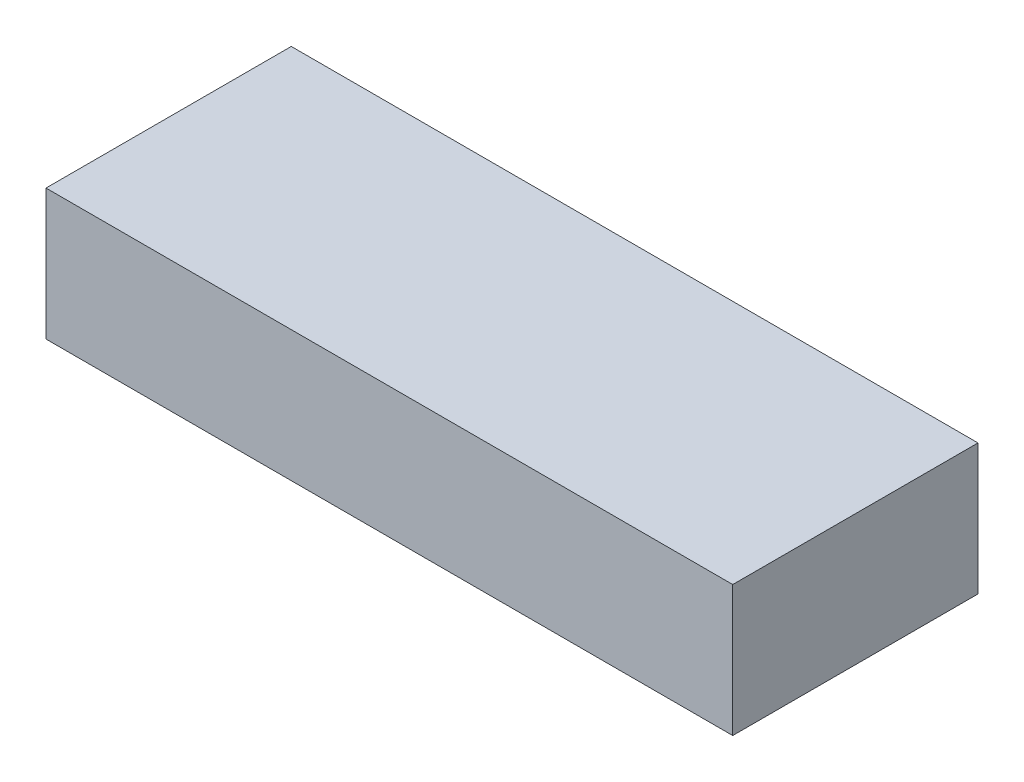
ISO-10303-21;
HEADER;
FILE_DESCRIPTION(('STEP AP214'),'2;1');
FILE_NAME('part.step','',(''),(''),'','','');
FILE_SCHEMA(('AUTOMOTIVE_DESIGN { 1 0 10303 214 1 1 1 1 }'));
ENDSEC;
DATA;
#1=APPLICATION_CONTEXT('core data for automotive mechanical design processes');
#2=APPLICATION_PROTOCOL_DEFINITION('international standard','automotive_design',2000,#1);
#3=PRODUCT_CONTEXT('',#1,'mechanical');
#4=PRODUCT('Part','Part','',(#3));
#5=PRODUCT_RELATED_PRODUCT_CATEGORY('part','',(#4));
#6=PRODUCT_DEFINITION_FORMATION('','',#4);
#7=PRODUCT_DEFINITION_CONTEXT('part definition',#1,'design');
#8=PRODUCT_DEFINITION('design','',#6,#7);
#9=PRODUCT_DEFINITION_SHAPE('','',#8);
#10=(LENGTH_UNIT() NAMED_UNIT(*) SI_UNIT(.MILLI.,.METRE.));
#11=(NAMED_UNIT(*) PLANE_ANGLE_UNIT() SI_UNIT($,.RADIAN.));
#12=(NAMED_UNIT(*) SI_UNIT($,.STERADIAN.) SOLID_ANGLE_UNIT());
#13=UNCERTAINTY_MEASURE_WITH_UNIT(LENGTH_MEASURE(1.E-05),#10,'distance_accuracy_value','');
#14=(GEOMETRIC_REPRESENTATION_CONTEXT(3) GLOBAL_UNCERTAINTY_ASSIGNED_CONTEXT((#13)) GLOBAL_UNIT_ASSIGNED_CONTEXT((#10,
#11,#12)) REPRESENTATION_CONTEXT('',''));
#15=CARTESIAN_POINT('',(0.,0.,0.));
#16=DIRECTION('',(0.,0.,1.));
#17=DIRECTION('',(1.,0.,0.));
#18=AXIS2_PLACEMENT_3D('',#15,#16,#17);
#19=CARTESIAN_POINT('',(-66.675,25.4,23.8125));
#20=DIRECTION('',(1.,0.,0.));
#21=DIRECTION('',(0.,0.,-1.));
#22=AXIS2_PLACEMENT_3D('',#19,#20,#21);
#23=PLANE('',#22);
#24=DIRECTION('',(0.,0.,1.));
#25=VECTOR('',#24,1.);
#26=CARTESIAN_POINT('',(-66.675,0.,23.8125));
#27=LINE('',#26,#25);
#28=CARTESIAN_POINT('',(-66.675,0.,-23.8125));
#29=VERTEX_POINT('',#28);
#30=CARTESIAN_POINT('',(-66.675,0.,23.8125));
#31=VERTEX_POINT('',#30);
#32=EDGE_CURVE('E96',#29,#31,#27,.T.);
#33=ORIENTED_EDGE('',*,*,#32,.T.);
#34=DIRECTION('',(0.,-1.,0.));
#35=VECTOR('',#34,1.);
#36=CARTESIAN_POINT('',(-66.675,25.4,23.8125));
#37=LINE('',#36,#35);
#38=CARTESIAN_POINT('',(-66.675,25.4,23.8125));
#39=VERTEX_POINT('',#38);
#40=EDGE_CURVE('E11',#39,#31,#37,.T.);
#41=ORIENTED_EDGE('',*,*,#40,.F.);
#42=DIRECTION('',(0.,0.,1.));
#43=VECTOR('',#42,1.);
#44=CARTESIAN_POINT('',(-66.675,25.4,23.8125));
#45=LINE('',#44,#43);
#46=CARTESIAN_POINT('',(-66.675,25.4,-23.8125));
#47=VERTEX_POINT('',#46);
#48=EDGE_CURVE('E84',#47,#39,#45,.T.);
#49=ORIENTED_EDGE('',*,*,#48,.F.);
#50=DIRECTION('',(0.,-1.,0.));
#51=VECTOR('',#50,1.);
#52=CARTESIAN_POINT('',(-66.675,25.4,-23.8125));
#53=LINE('',#52,#51);
#54=EDGE_CURVE('E92',#47,#29,#53,.T.);
#55=ORIENTED_EDGE('',*,*,#54,.T.);
#56=EDGE_LOOP('',(#33,#41,#49,#55));
#57=FACE_BOUND('',#56,.T.);
#58=ADVANCED_FACE('F33',(#57),#23,.F.);
#59=CARTESIAN_POINT('',(66.675,25.4,23.8125));
#60=DIRECTION('',(0.,0.,-1.));
#61=DIRECTION('',(-1.,0.,0.));
#62=AXIS2_PLACEMENT_3D('',#59,#60,#61);
#63=PLANE('',#62);
#64=DIRECTION('',(1.,0.,0.));
#65=VECTOR('',#64,1.);
#66=CARTESIAN_POINT('',(66.675,0.,23.8125));
#67=LINE('',#66,#65);
#68=CARTESIAN_POINT('',(66.675,0.,23.8125));
#69=VERTEX_POINT('',#68);
#70=EDGE_CURVE('E88',#31,#69,#67,.T.);
#71=ORIENTED_EDGE('',*,*,#70,.T.);
#72=DIRECTION('',(0.,-1.,0.));
#73=VECTOR('',#72,1.);
#74=CARTESIAN_POINT('',(66.675,25.4,23.8125));
#75=LINE('',#74,#73);
#76=CARTESIAN_POINT('',(66.675,25.4,23.8125));
#77=VERTEX_POINT('',#76);
#78=EDGE_CURVE('E41',#77,#69,#75,.T.);
#79=ORIENTED_EDGE('',*,*,#78,.F.);
#80=DIRECTION('',(1.,0.,0.));
#81=VECTOR('',#80,1.);
#82=CARTESIAN_POINT('',(66.675,25.4,23.8125));
#83=LINE('',#82,#81);
#84=EDGE_CURVE('E79',#39,#77,#83,.T.);
#85=ORIENTED_EDGE('',*,*,#84,.F.);
#86=ORIENTED_EDGE('',*,*,#40,.T.);
#87=EDGE_LOOP('',(#71,#79,#85,#86));
#88=FACE_BOUND('',#87,.T.);
#89=ADVANCED_FACE('F87',(#88),#63,.F.);
#90=CARTESIAN_POINT('',(66.675,25.4,23.8125));
#91=DIRECTION('',(-1.,0.,0.));
#92=DIRECTION('',(0.,0.,1.));
#93=AXIS2_PLACEMENT_3D('',#90,#91,#92);
#94=PLANE('',#93);
#95=DIRECTION('',(0.,0.,-1.));
#96=VECTOR('',#95,1.);
#97=CARTESIAN_POINT('',(66.675,0.,23.8125));
#98=LINE('',#97,#96);
#99=CARTESIAN_POINT('',(66.675,0.,-23.8125));
#100=VERTEX_POINT('',#99);
#101=EDGE_CURVE('E66',#69,#100,#98,.T.);
#102=ORIENTED_EDGE('',*,*,#101,.T.);
#103=DIRECTION('',(0.,-1.,0.));
#104=VECTOR('',#103,1.);
#105=CARTESIAN_POINT('',(66.675,25.4,-23.8125));
#106=LINE('',#105,#104);
#107=CARTESIAN_POINT('',(66.675,25.4,-23.8125));
#108=VERTEX_POINT('',#107);
#109=EDGE_CURVE('E89',#108,#100,#106,.T.);
#110=ORIENTED_EDGE('',*,*,#109,.F.);
#111=DIRECTION('',(0.,0.,-1.));
#112=VECTOR('',#111,1.);
#113=CARTESIAN_POINT('',(66.675,25.4,23.8125));
#114=LINE('',#113,#112);
#115=EDGE_CURVE('E82',#77,#108,#114,.T.);
#116=ORIENTED_EDGE('',*,*,#115,.F.);
#117=ORIENTED_EDGE('',*,*,#78,.T.);
#118=EDGE_LOOP('',(#102,#110,#116,#117));
#119=FACE_BOUND('',#118,.T.);
#120=ADVANCED_FACE('F90',(#119),#94,.F.);
#121=CARTESIAN_POINT('',(66.675,25.4,-23.8125));
#122=DIRECTION('',(0.,0.,1.));
#123=DIRECTION('',(1.,0.,0.));
#124=AXIS2_PLACEMENT_3D('',#121,#122,#123);
#125=PLANE('',#124);
#126=DIRECTION('',(-1.,0.,0.));
#127=VECTOR('',#126,1.);
#128=CARTESIAN_POINT('',(66.675,0.,-23.8125));
#129=LINE('',#128,#127);
#130=EDGE_CURVE('E72',#100,#29,#129,.T.);
#131=ORIENTED_EDGE('',*,*,#130,.T.);
#132=ORIENTED_EDGE('',*,*,#54,.F.);
#133=DIRECTION('',(-1.,0.,0.));
#134=VECTOR('',#133,1.);
#135=CARTESIAN_POINT('',(66.675,25.4,-23.8125));
#136=LINE('',#135,#134);
#137=EDGE_CURVE('E49',#108,#47,#136,.T.);
#138=ORIENTED_EDGE('',*,*,#137,.F.);
#139=ORIENTED_EDGE('',*,*,#109,.T.);
#140=EDGE_LOOP('',(#131,#132,#138,#139));
#141=FACE_BOUND('',#140,.T.);
#142=ADVANCED_FACE('F103',(#141),#125,.F.);
#143=CARTESIAN_POINT('',(0.,25.4,0.));
#144=DIRECTION('',(0.,1.,0.));
#145=DIRECTION('',(0.,0.,1.));
#146=AXIS2_PLACEMENT_3D('',#143,#144,#145);
#147=PLANE('',#146);
#148=ORIENTED_EDGE('',*,*,#48,.T.);
#149=ORIENTED_EDGE('',*,*,#84,.T.);
#150=ORIENTED_EDGE('',*,*,#115,.T.);
#151=ORIENTED_EDGE('',*,*,#137,.T.);
#152=EDGE_LOOP('',(#148,#149,#150,#151));
#153=FACE_BOUND('',#152,.T.);
#154=ADVANCED_FACE('F80',(#153),#147,.T.);
#155=CARTESIAN_POINT('',(0.,0.,0.));
#156=DIRECTION('',(0.,1.,0.));
#157=DIRECTION('',(0.,0.,1.));
#158=AXIS2_PLACEMENT_3D('',#155,#156,#157);
#159=PLANE('',#158);
#160=ORIENTED_EDGE('',*,*,#32,.F.);
#161=ORIENTED_EDGE('',*,*,#130,.F.);
#162=ORIENTED_EDGE('',*,*,#101,.F.);
#163=ORIENTED_EDGE('',*,*,#70,.F.);
#164=EDGE_LOOP('',(#160,#161,#162,#163));
#165=FACE_BOUND('',#164,.T.);
#166=ADVANCED_FACE('F106',(#165),#159,.F.);
#167=CLOSED_SHELL('',(#58,#89,#120,#142,#154,#166));
#168=MANIFOLD_SOLID_BREP('B2',#167);
#169=ADVANCED_BREP_SHAPE_REPRESENTATION('',(#18,#168),#14);
#170=SHAPE_DEFINITION_REPRESENTATION(#9,#169);
ENDSEC;
END-ISO-10303-21;
